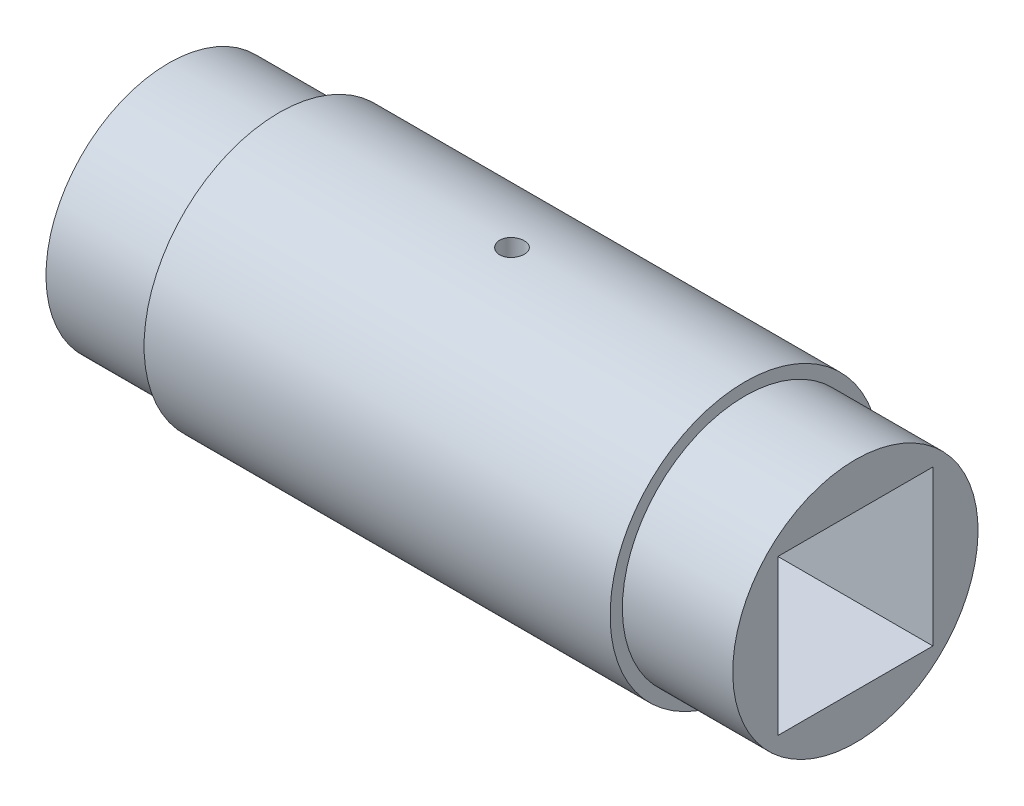
ISO-10303-21;
HEADER;
FILE_DESCRIPTION(('STEP AP214'),'2;1');
FILE_NAME('part.step','',(''),(''),'','','');
FILE_SCHEMA(('AUTOMOTIVE_DESIGN { 1 0 10303 214 1 1 1 1 }'));
ENDSEC;
DATA;
#1=APPLICATION_CONTEXT('core data for automotive mechanical design processes');
#2=APPLICATION_PROTOCOL_DEFINITION('international standard','automotive_design',2000,#1);
#3=PRODUCT_CONTEXT('',#1,'mechanical');
#4=PRODUCT('Part','Part','',(#3));
#5=PRODUCT_RELATED_PRODUCT_CATEGORY('part','',(#4));
#6=PRODUCT_DEFINITION_FORMATION('','',#4);
#7=PRODUCT_DEFINITION_CONTEXT('part definition',#1,'design');
#8=PRODUCT_DEFINITION('design','',#6,#7);
#9=PRODUCT_DEFINITION_SHAPE('','',#8);
#10=(LENGTH_UNIT() NAMED_UNIT(*) SI_UNIT(.MILLI.,.METRE.));
#11=(NAMED_UNIT(*) PLANE_ANGLE_UNIT() SI_UNIT($,.RADIAN.));
#12=(NAMED_UNIT(*) SI_UNIT($,.STERADIAN.) SOLID_ANGLE_UNIT());
#13=UNCERTAINTY_MEASURE_WITH_UNIT(LENGTH_MEASURE(1.E-05),#10,'distance_accuracy_value','');
#14=(GEOMETRIC_REPRESENTATION_CONTEXT(3) GLOBAL_UNCERTAINTY_ASSIGNED_CONTEXT((#13)) GLOBAL_UNIT_ASSIGNED_CONTEXT((#10,
#11,#12)) REPRESENTATION_CONTEXT('',''));
#15=CARTESIAN_POINT('',(0.,0.,0.));
#16=DIRECTION('',(0.,0.,1.));
#17=DIRECTION('',(1.,0.,0.));
#18=AXIS2_PLACEMENT_3D('',#15,#16,#17);
#19=CARTESIAN_POINT('',(0.,0.,0.));
#20=DIRECTION('',(1.,0.,0.));
#21=DIRECTION('',(0.,1.,0.));
#22=AXIS2_PLACEMENT_3D('',#19,#20,#21);
#23=CYLINDRICAL_SURFACE('',#22,5.5);
#24=CARTESIAN_POINT('',(-9.5,0.,0.));
#25=DIRECTION('',(1.,0.,0.));
#26=DIRECTION('',(0.,1.,0.));
#27=AXIS2_PLACEMENT_3D('',#24,#25,#26);
#28=CIRCLE('',#27,5.5);
#29=CARTESIAN_POINT('',(-9.5,5.5,0.));
#30=VERTEX_POINT('',#29);
#31=EDGE_CURVE('E11',#30,#30,#28,.T.);
#32=ORIENTED_EDGE('',*,*,#31,.T.);
#33=EDGE_LOOP('',(#32));
#34=FACE_BOUND('',#33,.T.);
#35=CARTESIAN_POINT('',(9.5,0.,0.));
#36=DIRECTION('',(1.,0.,0.));
#37=DIRECTION('',(0.,1.,0.));
#38=AXIS2_PLACEMENT_3D('',#35,#36,#37);
#39=CIRCLE('',#38,5.5);
#40=CARTESIAN_POINT('',(9.5,5.5,0.));
#41=VERTEX_POINT('',#40);
#42=EDGE_CURVE('E41',#41,#41,#39,.T.);
#43=ORIENTED_EDGE('',*,*,#42,.F.);
#44=EDGE_LOOP('',(#43));
#45=FACE_BOUND('',#44,.T.);
#46=CARTESIAN_POINT('',(-0.5,5.5,0.));
#47=CARTESIAN_POINT('',(-0.499998780369727,5.49999970422811,-0.0280231592049207));
#48=CARTESIAN_POINT('',(-0.497636179918532,5.49978354798966,-0.0560651581524767));
#49=CARTESIAN_POINT('',(-0.488246468082839,5.49894204171962,-0.111372612955002));
#50=CARTESIAN_POINT('',(-0.481214135016638,5.49831623362765,-0.138637163835006));
#51=CARTESIAN_POINT('',(-0.462690592551172,5.49672610981891,-0.19158074286576));
#52=CARTESIAN_POINT('',(-0.451201979725619,5.49576199125914,-0.217260684251457));
#53=CARTESIAN_POINT('',(-0.424096817123764,5.49360323078401,-0.266321797032524));
#54=CARTESIAN_POINT('',(-0.408481123419731,5.49240863668959,-0.289703443780318));
#55=CARTESIAN_POINT('',(-0.373514586254036,5.48991886218506,-0.333580372295819));
#56=CARTESIAN_POINT('',(-0.3541538949779,5.48862342207938,-0.354067792090479));
#57=CARTESIAN_POINT('',(-0.312267849979899,5.48608012485499,-0.391507192636557));
#58=CARTESIAN_POINT('',(-0.289742354194568,5.4848322698755,-0.408459014595221));
#59=CARTESIAN_POINT('',(-0.242117746196177,5.48252270604257,-0.438373221382788));
#60=CARTESIAN_POINT('',(-0.217014215487478,5.48146132551806,-0.451328599311858));
#61=CARTESIAN_POINT('',(-0.164976859227189,5.47964797884095,-0.472837413285433));
#62=CARTESIAN_POINT('',(-0.138043071565971,5.47889600628519,-0.481390940426587));
#63=CARTESIAN_POINT('',(-0.0831892155828176,5.47778888088428,-0.493830204377201));
#64=CARTESIAN_POINT('',(-0.0552721000083885,5.47743262974763,-0.497728862649788));
#65=CARTESIAN_POINT('',(0.000822347430821719,5.47715384245817,-0.500787649204484));
#66=CARTESIAN_POINT('',(0.0289996735544636,5.47723129675905,-0.499947881784364));
#67=CARTESIAN_POINT('',(0.0847259163486579,5.47781016845644,-0.493564320989138));
#68=CARTESIAN_POINT('',(0.112276459917374,5.47831031763818,-0.488034598746399));
#69=CARTESIAN_POINT('',(0.16605677357581,5.47967623966421,-0.472449972256089));
#70=CARTESIAN_POINT('',(0.192286528618293,5.48054201667289,-0.462395016467234));
#71=CARTESIAN_POINT('',(0.242725371930718,5.48254310339975,-0.438029687850329));
#72=CARTESIAN_POINT('',(0.266931408819005,5.48367881055503,-0.423713032301006));
#73=CARTESIAN_POINT('',(0.312602317115742,5.48609143955277,-0.391235224035641));
#74=CARTESIAN_POINT('',(0.334067122296658,5.48736836480565,-0.373073978463342));
#75=CARTESIAN_POINT('',(0.373728055060391,5.48992519969477,-0.333343742949946));
#76=CARTESIAN_POINT('',(0.391912004734078,5.49120510328367,-0.311762593730739));
#77=CARTESIAN_POINT('',(0.42440079411702,5.49361927337013,-0.265847494851441));
#78=CARTESIAN_POINT('',(0.438705630538722,5.49475353974426,-0.241513542858374));
#79=CARTESIAN_POINT('',(0.463029490088921,5.496748915679,-0.190775448712938));
#80=CARTESIAN_POINT('',(0.473047939932395,5.49760998869724,-0.164371030203398));
#81=CARTESIAN_POINT('',(0.488505940999597,5.49896156183881,-0.110245309563279));
#82=CARTESIAN_POINT('',(0.493945605339855,5.49945207111668,-0.0825240399826996));
#83=CARTESIAN_POINT('',(0.500076276878948,5.50000607478535,-0.0266570370891826));
#84=CARTESIAN_POINT('',(0.500784097889306,5.50007108111231,0.0014868367702991));
#85=CARTESIAN_POINT('',(0.497475086232374,5.49977079950969,0.057492831904835));
#86=CARTESIAN_POINT('',(0.493458306151711,5.4994055163694,0.0853549563123875));
#87=CARTESIAN_POINT('',(0.480828055578101,5.49828669213833,0.139958353353672));
#88=CARTESIAN_POINT('',(0.472222412775175,5.497533812286,0.166701451293985));
#89=CARTESIAN_POINT('',(0.450666735579948,5.49572432078554,0.218364283158946));
#90=CARTESIAN_POINT('',(0.437716619965759,5.49466770345893,0.24328398298373));
#91=CARTESIAN_POINT('',(0.407797590072428,5.49236530287406,0.290668942574678));
#92=CARTESIAN_POINT('',(0.390817576639165,5.49111900064764,0.313127168682639));
#93=CARTESIAN_POINT('',(0.353336732985085,5.48857888394948,0.354880588359833));
#94=CARTESIAN_POINT('',(0.332835829907872,5.487285068495,0.37417571646016));
#95=CARTESIAN_POINT('',(0.288822015582349,5.48479123812245,0.409113202059675));
#96=CARTESIAN_POINT('',(0.2653003544954,5.48359151267831,0.424744560166803));
#97=CARTESIAN_POINT('',(0.215956098661597,5.48142594168952,0.45183528576589));
#98=CARTESIAN_POINT('',(0.190133530603986,5.48046009343251,0.46329470164222));
#99=CARTESIAN_POINT('',(0.136958885769066,5.47887334640146,0.481697654374512));
#100=CARTESIAN_POINT('',(0.109609126800393,5.47825193973457,0.488647842859843));
#101=CARTESIAN_POINT('',(0.054124911298523,5.47742279241442,0.497856675512856));
#102=CARTESIAN_POINT('',(0.0259904730481669,5.4772150421312,0.500115428897468));
#103=CARTESIAN_POINT('',(-0.0301551529393403,5.47723689918491,0.499875903928244));
#104=CARTESIAN_POINT('',(-0.0581664166286598,5.47746491777569,0.497394905989183));
#105=CARTESIAN_POINT('',(-0.113372583010868,5.47832924009211,0.487782424039642));
#106=CARTESIAN_POINT('',(-0.140567484588714,5.4789655443754,0.480650933677505));
#107=CARTESIAN_POINT('',(-0.193369534770677,5.48057431517205,0.46194445518366));
#108=CARTESIAN_POINT('',(-0.218976825535462,5.48154675153545,0.450369865573255));
#109=CARTESIAN_POINT('',(-0.267887743996407,5.48371827537212,0.423107604619452));
#110=CARTESIAN_POINT('',(-0.29119139775036,5.48491736028119,0.40741997980835));
#111=CARTESIAN_POINT('',(-0.334922060097493,5.48741229435697,0.372311991861546));
#112=CARTESIAN_POINT('',(-0.355338740839583,5.48870846675739,0.352878787159225));
#113=CARTESIAN_POINT('',(-0.392629532759134,5.49124857040246,0.310855694151583));
#114=CARTESIAN_POINT('',(-0.409502789405325,5.49249248898788,0.28826504658084));
#115=CARTESIAN_POINT('',(-0.439254969249976,5.49479060233232,0.240516829112202));
#116=CARTESIAN_POINT('',(-0.452125260970347,5.49584438508202,0.215353865610505));
#117=CARTESIAN_POINT('',(-0.47344125933649,5.49763883849743,0.163231157148374));
#118=CARTESIAN_POINT('',(-0.481892010034793,5.49837986592564,0.136273500287851));
#119=CARTESIAN_POINT('',(-0.491996206011047,5.4992768213549,0.0909662821338328));
#120=CARTESIAN_POINT('',(-0.494993591457311,5.49954676583957,0.0729073684892469));
#121=CARTESIAN_POINT('',(-0.498995883169427,5.49990845138286,0.036568310687836));
#122=CARTESIAN_POINT('',(-0.500000795941752,5.50000019302341,0.0182881672536386));
#123=CARTESIAN_POINT('',(-0.5,5.5,0.));
#124=B_SPLINE_CURVE_WITH_KNOTS('',3,(#46,#47,#48,#49,#50,#51,#52,#53,#54,#55,#56,#57,#58,#59,
#60,#61,#62,#63,#64,#65,#66,#67,#68,#69,#70,#71,#72,#73,#74,#75,#76,#77,#78,#79,#80,#81,#82,#83,
#84,#85,#86,#87,#88,#89,#90,#91,#92,#93,#94,#95,#96,#97,#98,#99,#100,#101,#102,#103,#104,#105,
#106,#107,#108,#109,#110,#111,#112,#113,#114,#115,#116,#117,#118,#119,#120,#121,#122,#123),
.UNSPECIFIED.,.T.,.F.,(4,2,2,2,2,2,2,2,2,2,2,2,2,2,2,2,2,2,2,2,2,2,2,2,2,2,2,2,2,2,2,2,2,2,2,2,
2,2,4),(0.,0.0840027016469972,0.168099493407258,0.25214735729491,0.336177800963829,
0.420432290381357,0.504690563069289,0.589095735605641,0.673499161300054,0.757667742490398,
0.841834471048316,0.92574956634017,1.00966561742829,1.09370599789051,1.1777484083652,
1.26209662334485,1.34644490980946,1.43080447395608,1.5151619539821,1.59921952378762,
1.68327615800894,1.76718986481475,1.85110514051275,1.93525427427553,2.0194051495134,
2.10380551644678,2.18820490451024,2.27247950898064,2.35675215151047,2.44071813500626,
2.52468423318333,2.60864280182727,2.69260042065772,2.77685117639935,2.86112222675882,
2.94557374837784,3.02992867338478,3.08474977556497,3.13957069872512),.UNSPECIFIED.);
#125=CARTESIAN_POINT('',(-0.5,5.5,0.));
#126=VERTEX_POINT('',#125);
#127=EDGE_CURVE('E98',#126,#126,#124,.T.);
#128=ORIENTED_EDGE('',*,*,#127,.T.);
#129=EDGE_LOOP('',(#128));
#130=FACE_BOUND('',#129,.T.);
#131=ADVANCED_FACE('F32',(#34,#45,#130),#23,.T.);
#132=CARTESIAN_POINT('',(14.,3.16,-3.16));
#133=DIRECTION('',(0.,1.,0.));
#134=DIRECTION('',(-1.,0.,0.));
#135=AXIS2_PLACEMENT_3D('',#132,#133,#134);
#136=PLANE('',#135);
#137=DIRECTION('',(0.,0.,-1.));
#138=VECTOR('',#137,1.);
#139=CARTESIAN_POINT('',(-14.,3.16,-3.16));
#140=LINE('',#139,#138);
#141=CARTESIAN_POINT('',(-14.,3.16,3.16));
#142=VERTEX_POINT('',#141);
#143=CARTESIAN_POINT('',(-14.,3.16,-3.16));
#144=VERTEX_POINT('',#143);
#145=EDGE_CURVE('E92',#142,#144,#140,.T.);
#146=ORIENTED_EDGE('',*,*,#145,.T.);
#147=DIRECTION('',(-1.,0.,0.));
#148=VECTOR('',#147,1.);
#149=CARTESIAN_POINT('',(14.,3.16,-3.16));
#150=LINE('',#149,#148);
#151=CARTESIAN_POINT('',(14.,3.16,-3.16));
#152=VERTEX_POINT('',#151);
#153=EDGE_CURVE('E110',#152,#144,#150,.T.);
#154=ORIENTED_EDGE('',*,*,#153,.F.);
#155=DIRECTION('',(0.,0.,-1.));
#156=VECTOR('',#155,1.);
#157=CARTESIAN_POINT('',(14.,3.16,-3.16));
#158=LINE('',#157,#156);
#159=CARTESIAN_POINT('',(14.,3.16,3.16));
#160=VERTEX_POINT('',#159);
#161=EDGE_CURVE('E82',#160,#152,#158,.T.);
#162=ORIENTED_EDGE('',*,*,#161,.F.);
#163=DIRECTION('',(-1.,0.,0.));
#164=VECTOR('',#163,1.);
#165=CARTESIAN_POINT('',(14.,3.16,3.16));
#166=LINE('',#165,#164);
#167=EDGE_CURVE('E113',#160,#142,#166,.T.);
#168=ORIENTED_EDGE('',*,*,#167,.T.);
#169=EDGE_LOOP('',(#146,#154,#162,#168));
#170=FACE_BOUND('',#169,.T.);
#171=CARTESIAN_POINT('',(0.,3.16,0.));
#172=DIRECTION('',(0.,1.,0.));
#173=DIRECTION('',(-1.,0.,0.));
#174=AXIS2_PLACEMENT_3D('',#171,#172,#173);
#175=CIRCLE('',#174,0.5);
#176=CARTESIAN_POINT('',(-0.5,3.16,0.));
#177=VERTEX_POINT('',#176);
#178=EDGE_CURVE('E36',#177,#177,#175,.F.);
#179=ORIENTED_EDGE('',*,*,#178,.F.);
#180=EDGE_LOOP('',(#179));
#181=FACE_BOUND('',#180,.T.);
#182=ADVANCED_FACE('F135',(#170,#181),#136,.F.);
#183=CARTESIAN_POINT('',(-9.5,5.5,0.));
#184=DIRECTION('',(-1.,0.,0.));
#185=DIRECTION('',(0.,-1.,0.));
#186=AXIS2_PLACEMENT_3D('',#183,#184,#185);
#187=PLANE('',#186);
#188=CARTESIAN_POINT('',(-9.5,0.,0.));
#189=DIRECTION('',(1.,0.,0.));
#190=DIRECTION('',(0.,1.,0.));
#191=AXIS2_PLACEMENT_3D('',#188,#189,#190);
#192=CIRCLE('',#191,5.);
#193=CARTESIAN_POINT('',(-9.5,5.,0.));
#194=VERTEX_POINT('',#193);
#195=EDGE_CURVE('E112',#194,#194,#192,.T.);
#196=ORIENTED_EDGE('',*,*,#195,.T.);
#197=EDGE_LOOP('',(#196));
#198=FACE_BOUND('',#197,.T.);
#199=ORIENTED_EDGE('',*,*,#31,.F.);
#200=EDGE_LOOP('',(#199));
#201=FACE_BOUND('',#200,.T.);
#202=ADVANCED_FACE('F34',(#198,#201),#187,.T.);
#203=CARTESIAN_POINT('',(9.5,5.5,0.));
#204=DIRECTION('',(1.,0.,0.));
#205=DIRECTION('',(0.,1.,0.));
#206=AXIS2_PLACEMENT_3D('',#203,#204,#205);
#207=PLANE('',#206);
#208=ORIENTED_EDGE('',*,*,#42,.T.);
#209=EDGE_LOOP('',(#208));
#210=FACE_BOUND('',#209,.T.);
#211=CARTESIAN_POINT('',(9.5,0.,0.));
#212=DIRECTION('',(1.,0.,0.));
#213=DIRECTION('',(0.,1.,0.));
#214=AXIS2_PLACEMENT_3D('',#211,#212,#213);
#215=CIRCLE('',#214,5.);
#216=CARTESIAN_POINT('',(9.5,5.,0.));
#217=VERTEX_POINT('',#216);
#218=EDGE_CURVE('E124',#217,#217,#215,.T.);
#219=ORIENTED_EDGE('',*,*,#218,.F.);
#220=EDGE_LOOP('',(#219));
#221=FACE_BOUND('',#220,.T.);
#222=ADVANCED_FACE('F130',(#210,#221),#207,.T.);
#223=CARTESIAN_POINT('',(0.,0.,0.));
#224=DIRECTION('',(1.,0.,0.));
#225=DIRECTION('',(0.,1.,0.));
#226=AXIS2_PLACEMENT_3D('',#223,#224,#225);
#227=CYLINDRICAL_SURFACE('',#226,5.);
#228=ORIENTED_EDGE('',*,*,#218,.T.);
#229=EDGE_LOOP('',(#228));
#230=FACE_BOUND('',#229,.T.);
#231=CARTESIAN_POINT('',(14.,0.,0.));
#232=DIRECTION('',(1.,0.,0.));
#233=DIRECTION('',(0.,1.,0.));
#234=AXIS2_PLACEMENT_3D('',#231,#232,#233);
#235=CIRCLE('',#234,5.);
#236=CARTESIAN_POINT('',(14.,5.,0.));
#237=VERTEX_POINT('',#236);
#238=EDGE_CURVE('E121',#237,#237,#235,.T.);
#239=ORIENTED_EDGE('',*,*,#238,.F.);
#240=EDGE_LOOP('',(#239));
#241=FACE_BOUND('',#240,.T.);
#242=ADVANCED_FACE('F171',(#230,#241),#227,.T.);
#243=CARTESIAN_POINT('',(14.,5.,0.));
#244=DIRECTION('',(1.,0.,0.));
#245=DIRECTION('',(0.,1.,0.));
#246=AXIS2_PLACEMENT_3D('',#243,#244,#245);
#247=PLANE('',#246);
#248=DIRECTION('',(0.,-1.,0.));
#249=VECTOR('',#248,1.);
#250=CARTESIAN_POINT('',(14.,3.16,-3.16));
#251=LINE('',#250,#249);
#252=CARTESIAN_POINT('',(14.,-3.16,-3.16));
#253=VERTEX_POINT('',#252);
#254=EDGE_CURVE('E76',#152,#253,#251,.T.);
#255=ORIENTED_EDGE('',*,*,#254,.T.);
#256=DIRECTION('',(0.,0.,1.));
#257=VECTOR('',#256,1.);
#258=CARTESIAN_POINT('',(14.,-3.16,-3.16));
#259=LINE('',#258,#257);
#260=CARTESIAN_POINT('',(14.,-3.16,3.16));
#261=VERTEX_POINT('',#260);
#262=EDGE_CURVE('E85',#253,#261,#259,.T.);
#263=ORIENTED_EDGE('',*,*,#262,.T.);
#264=DIRECTION('',(0.,1.,0.));
#265=VECTOR('',#264,1.);
#266=CARTESIAN_POINT('',(14.,3.16,3.16));
#267=LINE('',#266,#265);
#268=EDGE_CURVE('E48',#261,#160,#267,.T.);
#269=ORIENTED_EDGE('',*,*,#268,.T.);
#270=ORIENTED_EDGE('',*,*,#161,.T.);
#271=EDGE_LOOP('',(#255,#263,#269,#270));
#272=FACE_BOUND('',#271,.T.);
#273=ORIENTED_EDGE('',*,*,#238,.T.);
#274=EDGE_LOOP('',(#273));
#275=FACE_BOUND('',#274,.T.);
#276=ADVANCED_FACE('F89',(#272,#275),#247,.T.);
#277=CARTESIAN_POINT('',(-14.,5.,0.));
#278=DIRECTION('',(-1.,0.,0.));
#279=DIRECTION('',(0.,-1.,0.));
#280=AXIS2_PLACEMENT_3D('',#277,#278,#279);
#281=PLANE('',#280);
#282=DIRECTION('',(0.,-1.,0.));
#283=VECTOR('',#282,1.);
#284=CARTESIAN_POINT('',(-14.,3.16,-3.16));
#285=LINE('',#284,#283);
#286=CARTESIAN_POINT('',(-14.,-3.16,-3.16));
#287=VERTEX_POINT('',#286);
#288=EDGE_CURVE('E56',#144,#287,#285,.T.);
#289=ORIENTED_EDGE('',*,*,#288,.F.);
#290=ORIENTED_EDGE('',*,*,#145,.F.);
#291=DIRECTION('',(0.,1.,0.));
#292=VECTOR('',#291,1.);
#293=CARTESIAN_POINT('',(-14.,3.16,3.16));
#294=LINE('',#293,#292);
#295=CARTESIAN_POINT('',(-14.,-3.16,3.16));
#296=VERTEX_POINT('',#295);
#297=EDGE_CURVE('E95',#296,#142,#294,.T.);
#298=ORIENTED_EDGE('',*,*,#297,.F.);
#299=DIRECTION('',(0.,0.,1.));
#300=VECTOR('',#299,1.);
#301=CARTESIAN_POINT('',(-14.,-3.16,-3.16));
#302=LINE('',#301,#300);
#303=EDGE_CURVE('E106',#287,#296,#302,.T.);
#304=ORIENTED_EDGE('',*,*,#303,.F.);
#305=EDGE_LOOP('',(#289,#290,#298,#304));
#306=FACE_BOUND('',#305,.T.);
#307=CARTESIAN_POINT('',(-14.,0.,0.));
#308=DIRECTION('',(1.,0.,0.));
#309=DIRECTION('',(0.,1.,0.));
#310=AXIS2_PLACEMENT_3D('',#307,#308,#309);
#311=CIRCLE('',#310,5.);
#312=CARTESIAN_POINT('',(-14.,5.,0.));
#313=VERTEX_POINT('',#312);
#314=EDGE_CURVE('E118',#313,#313,#311,.T.);
#315=ORIENTED_EDGE('',*,*,#314,.F.);
#316=EDGE_LOOP('',(#315));
#317=FACE_BOUND('',#316,.T.);
#318=ADVANCED_FACE('F164',(#306,#317),#281,.T.);
#319=CARTESIAN_POINT('',(0.,0.,0.));
#320=DIRECTION('',(1.,0.,0.));
#321=DIRECTION('',(0.,1.,0.));
#322=AXIS2_PLACEMENT_3D('',#319,#320,#321);
#323=CYLINDRICAL_SURFACE('',#322,5.);
#324=ORIENTED_EDGE('',*,*,#314,.T.);
#325=EDGE_LOOP('',(#324));
#326=FACE_BOUND('',#325,.T.);
#327=ORIENTED_EDGE('',*,*,#195,.F.);
#328=EDGE_LOOP('',(#327));
#329=FACE_BOUND('',#328,.T.);
#330=ADVANCED_FACE('F161',(#326,#329),#323,.T.);
#331=CARTESIAN_POINT('',(14.,3.16,-3.16));
#332=DIRECTION('',(0.,0.,-1.));
#333=DIRECTION('',(-1.,0.,0.));
#334=AXIS2_PLACEMENT_3D('',#331,#332,#333);
#335=PLANE('',#334);
#336=ORIENTED_EDGE('',*,*,#288,.T.);
#337=DIRECTION('',(-1.,0.,0.));
#338=VECTOR('',#337,1.);
#339=CARTESIAN_POINT('',(14.,-3.16,-3.16));
#340=LINE('',#339,#338);
#341=EDGE_CURVE('E72',#253,#287,#340,.T.);
#342=ORIENTED_EDGE('',*,*,#341,.F.);
#343=ORIENTED_EDGE('',*,*,#254,.F.);
#344=ORIENTED_EDGE('',*,*,#153,.T.);
#345=EDGE_LOOP('',(#336,#342,#343,#344));
#346=FACE_BOUND('',#345,.T.);
#347=ADVANCED_FACE('F74',(#346),#335,.F.);
#348=CARTESIAN_POINT('',(14.,3.16,3.16));
#349=DIRECTION('',(0.,0.,1.));
#350=DIRECTION('',(1.,0.,0.));
#351=AXIS2_PLACEMENT_3D('',#348,#349,#350);
#352=PLANE('',#351);
#353=ORIENTED_EDGE('',*,*,#297,.T.);
#354=ORIENTED_EDGE('',*,*,#167,.F.);
#355=ORIENTED_EDGE('',*,*,#268,.F.);
#356=DIRECTION('',(-1.,0.,0.));
#357=VECTOR('',#356,1.);
#358=CARTESIAN_POINT('',(14.,-3.16,3.16));
#359=LINE('',#358,#357);
#360=EDGE_CURVE('E81',#261,#296,#359,.T.);
#361=ORIENTED_EDGE('',*,*,#360,.T.);
#362=EDGE_LOOP('',(#353,#354,#355,#361));
#363=FACE_BOUND('',#362,.T.);
#364=ADVANCED_FACE('F154',(#363),#352,.F.);
#365=CARTESIAN_POINT('',(14.,-3.16,-3.16));
#366=DIRECTION('',(0.,-1.,0.));
#367=DIRECTION('',(1.,0.,0.));
#368=AXIS2_PLACEMENT_3D('',#365,#366,#367);
#369=PLANE('',#368);
#370=ORIENTED_EDGE('',*,*,#303,.T.);
#371=ORIENTED_EDGE('',*,*,#360,.F.);
#372=ORIENTED_EDGE('',*,*,#262,.F.);
#373=ORIENTED_EDGE('',*,*,#341,.T.);
#374=EDGE_LOOP('',(#370,#371,#372,#373));
#375=FACE_BOUND('',#374,.T.);
#376=ADVANCED_FACE('F86',(#375),#369,.F.);
#377=CARTESIAN_POINT('',(0.,5.5,0.));
#378=DIRECTION('',(0.,-1.,0.));
#379=DIRECTION('',(0.,0.,-1.));
#380=AXIS2_PLACEMENT_3D('',#377,#378,#379);
#381=CYLINDRICAL_SURFACE('',#380,0.5);
#382=ORIENTED_EDGE('',*,*,#127,.F.);
#383=EDGE_LOOP('',(#382));
#384=FACE_BOUND('',#383,.T.);
#385=ORIENTED_EDGE('',*,*,#178,.T.);
#386=EDGE_LOOP('',(#385));
#387=FACE_BOUND('',#386,.T.);
#388=ADVANCED_FACE('F143',(#384,#387),#381,.F.);
#389=CLOSED_SHELL('',(#131,#182,#202,#222,#242,#276,#318,#330,#347,#364,#376,#388));
#390=MANIFOLD_SOLID_BREP('B2',#389);
#391=ADVANCED_BREP_SHAPE_REPRESENTATION('',(#18,#390),#14);
#392=SHAPE_DEFINITION_REPRESENTATION(#9,#391);
ENDSEC;
END-ISO-10303-21;
